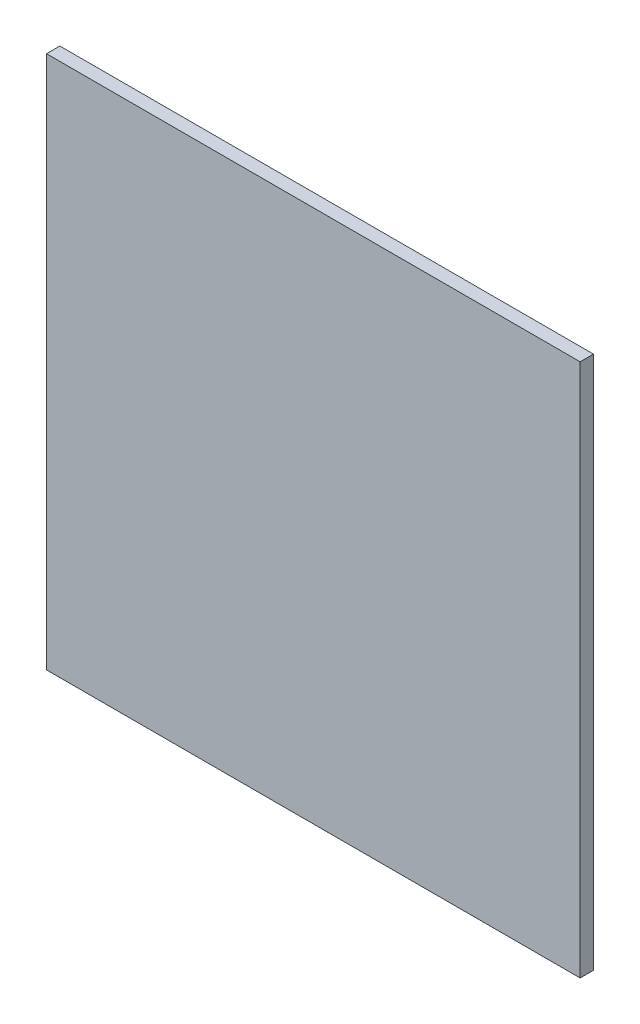
ISO-10303-21;
HEADER;
FILE_DESCRIPTION(('STEP AP214'),'2;1');
FILE_NAME('part.step','',(''),(''),'','','');
FILE_SCHEMA(('AUTOMOTIVE_DESIGN { 1 0 10303 214 1 1 1 1 }'));
ENDSEC;
DATA;
#1=APPLICATION_CONTEXT('core data for automotive mechanical design processes');
#2=APPLICATION_PROTOCOL_DEFINITION('international standard','automotive_design',2000,#1);
#3=PRODUCT_CONTEXT('',#1,'mechanical');
#4=PRODUCT('Part','Part','',(#3));
#5=PRODUCT_RELATED_PRODUCT_CATEGORY('part','',(#4));
#6=PRODUCT_DEFINITION_FORMATION('','',#4);
#7=PRODUCT_DEFINITION_CONTEXT('part definition',#1,'design');
#8=PRODUCT_DEFINITION('design','',#6,#7);
#9=PRODUCT_DEFINITION_SHAPE('','',#8);
#10=(LENGTH_UNIT() NAMED_UNIT(*) SI_UNIT(.MILLI.,.METRE.));
#11=(NAMED_UNIT(*) PLANE_ANGLE_UNIT() SI_UNIT($,.RADIAN.));
#12=(NAMED_UNIT(*) SI_UNIT($,.STERADIAN.) SOLID_ANGLE_UNIT());
#13=UNCERTAINTY_MEASURE_WITH_UNIT(LENGTH_MEASURE(1.E-05),#10,'distance_accuracy_value','');
#14=(GEOMETRIC_REPRESENTATION_CONTEXT(3) GLOBAL_UNCERTAINTY_ASSIGNED_CONTEXT((#13)) GLOBAL_UNIT_ASSIGNED_CONTEXT((#10,
#11,#12)) REPRESENTATION_CONTEXT('',''));
#15=CARTESIAN_POINT('',(0.,0.,0.));
#16=DIRECTION('',(0.,0.,1.));
#17=DIRECTION('',(1.,0.,0.));
#18=AXIS2_PLACEMENT_3D('',#15,#16,#17);
#19=CARTESIAN_POINT('',(1.,-1.,0.05));
#20=DIRECTION('',(-1.,0.,0.));
#21=DIRECTION('',(0.,0.,1.));
#22=AXIS2_PLACEMENT_3D('',#19,#20,#21);
#23=PLANE('',#22);
#24=DIRECTION('',(0.,1.,0.));
#25=VECTOR('',#24,1.);
#26=CARTESIAN_POINT('',(1.,-1.,0.));
#27=LINE('',#26,#25);
#28=CARTESIAN_POINT('',(1.,-1.,0.));
#29=VERTEX_POINT('',#28);
#30=CARTESIAN_POINT('',(1.,1.,0.));
#31=VERTEX_POINT('',#30);
#32=EDGE_CURVE('E107',#29,#31,#27,.T.);
#33=ORIENTED_EDGE('',*,*,#32,.T.);
#34=DIRECTION('',(0.,0.,-1.));
#35=VECTOR('',#34,1.);
#36=CARTESIAN_POINT('',(1.,1.,0.05));
#37=LINE('',#36,#35);
#38=CARTESIAN_POINT('',(1.,1.,0.05));
#39=VERTEX_POINT('',#38);
#40=EDGE_CURVE('E11',#39,#31,#37,.T.);
#41=ORIENTED_EDGE('',*,*,#40,.F.);
#42=DIRECTION('',(0.,1.,0.));
#43=VECTOR('',#42,1.);
#44=CARTESIAN_POINT('',(1.,-1.,0.05));
#45=LINE('',#44,#43);
#46=CARTESIAN_POINT('',(1.,-1.,0.05));
#47=VERTEX_POINT('',#46);
#48=EDGE_CURVE('E91',#47,#39,#45,.T.);
#49=ORIENTED_EDGE('',*,*,#48,.F.);
#50=DIRECTION('',(0.,0.,-1.));
#51=VECTOR('',#50,1.);
#52=CARTESIAN_POINT('',(1.,-1.,0.05));
#53=LINE('',#52,#51);
#54=EDGE_CURVE('E103',#47,#29,#53,.T.);
#55=ORIENTED_EDGE('',*,*,#54,.T.);
#56=EDGE_LOOP('',(#33,#41,#49,#55));
#57=FACE_BOUND('',#56,.T.);
#58=ADVANCED_FACE('F39',(#57),#23,.F.);
#59=CARTESIAN_POINT('',(-1.,1.,0.05));
#60=DIRECTION('',(0.,-1.,0.));
#61=DIRECTION('',(0.,0.,-1.));
#62=AXIS2_PLACEMENT_3D('',#59,#60,#61);
#63=PLANE('',#62);
#64=DIRECTION('',(-1.,0.,0.));
#65=VECTOR('',#64,1.);
#66=CARTESIAN_POINT('',(-1.,1.,0.));
#67=LINE('',#66,#65);
#68=CARTESIAN_POINT('',(-1.,1.,0.));
#69=VERTEX_POINT('',#68);
#70=EDGE_CURVE('E96',#31,#69,#67,.T.);
#71=ORIENTED_EDGE('',*,*,#70,.T.);
#72=DIRECTION('',(0.,0.,-1.));
#73=VECTOR('',#72,1.);
#74=CARTESIAN_POINT('',(-1.,1.,0.05));
#75=LINE('',#74,#73);
#76=CARTESIAN_POINT('',(-1.,1.,0.05));
#77=VERTEX_POINT('',#76);
#78=EDGE_CURVE('E48',#77,#69,#75,.T.);
#79=ORIENTED_EDGE('',*,*,#78,.F.);
#80=DIRECTION('',(-1.,0.,0.));
#81=VECTOR('',#80,1.);
#82=CARTESIAN_POINT('',(-1.,1.,0.05));
#83=LINE('',#82,#81);
#84=EDGE_CURVE('E86',#39,#77,#83,.T.);
#85=ORIENTED_EDGE('',*,*,#84,.F.);
#86=ORIENTED_EDGE('',*,*,#40,.T.);
#87=EDGE_LOOP('',(#71,#79,#85,#86));
#88=FACE_BOUND('',#87,.T.);
#89=ADVANCED_FACE('F95',(#88),#63,.F.);
#90=CARTESIAN_POINT('',(-1.,-1.,0.05));
#91=DIRECTION('',(1.,0.,0.));
#92=DIRECTION('',(0.,0.,-1.));
#93=AXIS2_PLACEMENT_3D('',#90,#91,#92);
#94=PLANE('',#93);
#95=DIRECTION('',(0.,-1.,0.));
#96=VECTOR('',#95,1.);
#97=CARTESIAN_POINT('',(-1.,-1.,0.));
#98=LINE('',#97,#96);
#99=CARTESIAN_POINT('',(-1.,-1.,0.));
#100=VERTEX_POINT('',#99);
#101=EDGE_CURVE('E73',#69,#100,#98,.T.);
#102=ORIENTED_EDGE('',*,*,#101,.T.);
#103=DIRECTION('',(0.,0.,-1.));
#104=VECTOR('',#103,1.);
#105=CARTESIAN_POINT('',(-1.,-1.,0.05));
#106=LINE('',#105,#104);
#107=CARTESIAN_POINT('',(-1.,-1.,0.05));
#108=VERTEX_POINT('',#107);
#109=EDGE_CURVE('E98',#108,#100,#106,.T.);
#110=ORIENTED_EDGE('',*,*,#109,.F.);
#111=DIRECTION('',(0.,-1.,0.));
#112=VECTOR('',#111,1.);
#113=CARTESIAN_POINT('',(-1.,-1.,0.05));
#114=LINE('',#113,#112);
#115=EDGE_CURVE('E89',#77,#108,#114,.T.);
#116=ORIENTED_EDGE('',*,*,#115,.F.);
#117=ORIENTED_EDGE('',*,*,#78,.T.);
#118=EDGE_LOOP('',(#102,#110,#116,#117));
#119=FACE_BOUND('',#118,.T.);
#120=ADVANCED_FACE('F99',(#119),#94,.F.);
#121=CARTESIAN_POINT('',(-1.,-1.,0.05));
#122=DIRECTION('',(0.,1.,0.));
#123=DIRECTION('',(0.,0.,1.));
#124=AXIS2_PLACEMENT_3D('',#121,#122,#123);
#125=PLANE('',#124);
#126=DIRECTION('',(1.,0.,0.));
#127=VECTOR('',#126,1.);
#128=CARTESIAN_POINT('',(-1.,-1.,0.));
#129=LINE('',#128,#127);
#130=EDGE_CURVE('E79',#100,#29,#129,.T.);
#131=ORIENTED_EDGE('',*,*,#130,.T.);
#132=ORIENTED_EDGE('',*,*,#54,.F.);
#133=DIRECTION('',(1.,0.,0.));
#134=VECTOR('',#133,1.);
#135=CARTESIAN_POINT('',(-1.,-1.,0.05));
#136=LINE('',#135,#134);
#137=EDGE_CURVE('E56',#108,#47,#136,.T.);
#138=ORIENTED_EDGE('',*,*,#137,.F.);
#139=ORIENTED_EDGE('',*,*,#109,.T.);
#140=EDGE_LOOP('',(#131,#132,#138,#139));
#141=FACE_BOUND('',#140,.T.);
#142=ADVANCED_FACE('F120',(#141),#125,.F.);
#143=CARTESIAN_POINT('',(0.,0.,0.05));
#144=DIRECTION('',(0.,0.,-1.));
#145=DIRECTION('',(-1.,0.,0.));
#146=AXIS2_PLACEMENT_3D('',#143,#144,#145);
#147=PLANE('',#146);
#148=ORIENTED_EDGE('',*,*,#48,.T.);
#149=ORIENTED_EDGE('',*,*,#84,.T.);
#150=ORIENTED_EDGE('',*,*,#115,.T.);
#151=ORIENTED_EDGE('',*,*,#137,.T.);
#152=EDGE_LOOP('',(#148,#149,#150,#151));
#153=FACE_BOUND('',#152,.T.);
#154=ADVANCED_FACE('F87',(#153),#147,.F.);
#155=CARTESIAN_POINT('',(0.,0.,0.));
#156=DIRECTION('',(0.,0.,-1.));
#157=DIRECTION('',(-1.,0.,0.));
#158=AXIS2_PLACEMENT_3D('',#155,#156,#157);
#159=PLANE('',#158);
#160=ORIENTED_EDGE('',*,*,#32,.F.);
#161=ORIENTED_EDGE('',*,*,#130,.F.);
#162=ORIENTED_EDGE('',*,*,#101,.F.);
#163=ORIENTED_EDGE('',*,*,#70,.F.);
#164=EDGE_LOOP('',(#160,#161,#162,#163));
#165=FACE_BOUND('',#164,.T.);
#166=ADVANCED_FACE('F123',(#165),#159,.T.);
#167=CLOSED_SHELL('',(#58,#89,#120,#142,#154,#166));
#168=MANIFOLD_SOLID_BREP('B2',#167);
#169=ADVANCED_BREP_SHAPE_REPRESENTATION('',(#18,#168),#14);
#170=SHAPE_DEFINITION_REPRESENTATION(#9,#169);
ENDSEC;
END-ISO-10303-21;
